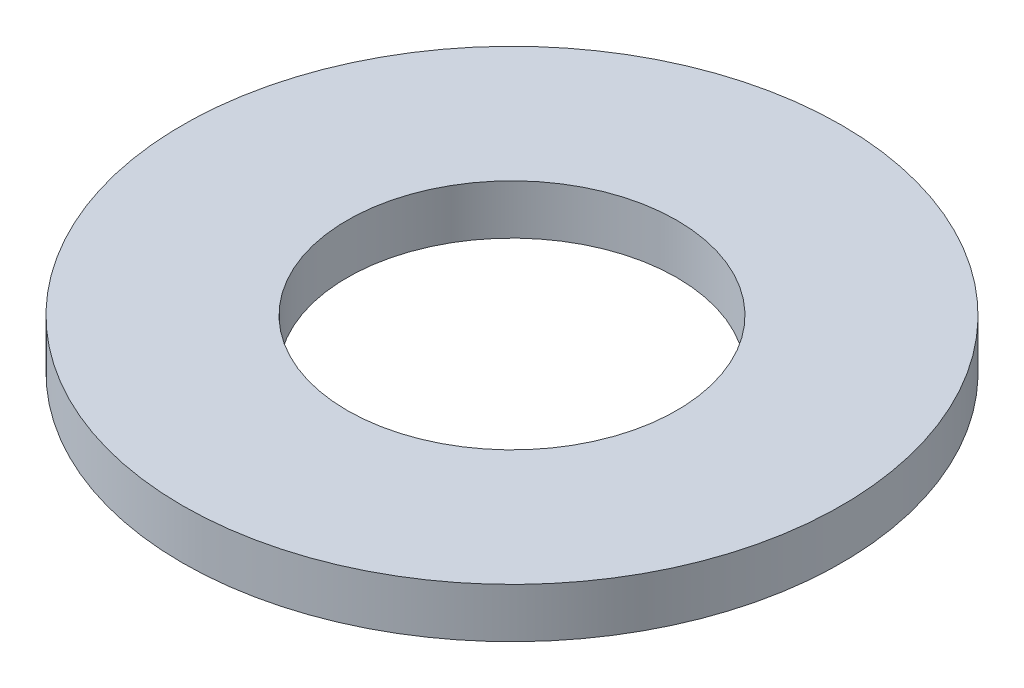
ISO-10303-21;
HEADER;
FILE_DESCRIPTION(('STEP AP214'),'2;1');
FILE_NAME('part.step','',(''),(''),'','','');
FILE_SCHEMA(('AUTOMOTIVE_DESIGN { 1 0 10303 214 1 1 1 1 }'));
ENDSEC;
DATA;
#1=APPLICATION_CONTEXT('core data for automotive mechanical design processes');
#2=APPLICATION_PROTOCOL_DEFINITION('international standard','automotive_design',2000,#1);
#3=PRODUCT_CONTEXT('',#1,'mechanical');
#4=PRODUCT('Part','Part','',(#3));
#5=PRODUCT_RELATED_PRODUCT_CATEGORY('part','',(#4));
#6=PRODUCT_DEFINITION_FORMATION('','',#4);
#7=PRODUCT_DEFINITION_CONTEXT('part definition',#1,'design');
#8=PRODUCT_DEFINITION('design','',#6,#7);
#9=PRODUCT_DEFINITION_SHAPE('','',#8);
#10=(LENGTH_UNIT() NAMED_UNIT(*) SI_UNIT(.MILLI.,.METRE.));
#11=(NAMED_UNIT(*) PLANE_ANGLE_UNIT() SI_UNIT($,.RADIAN.));
#12=(NAMED_UNIT(*) SI_UNIT($,.STERADIAN.) SOLID_ANGLE_UNIT());
#13=UNCERTAINTY_MEASURE_WITH_UNIT(LENGTH_MEASURE(1.E-05),#10,'distance_accuracy_value','');
#14=(GEOMETRIC_REPRESENTATION_CONTEXT(3) GLOBAL_UNCERTAINTY_ASSIGNED_CONTEXT((#13)) GLOBAL_UNIT_ASSIGNED_CONTEXT((#10,
#11,#12)) REPRESENTATION_CONTEXT('',''));
#15=CARTESIAN_POINT('',(0.,0.,0.));
#16=DIRECTION('',(0.,0.,1.));
#17=DIRECTION('',(1.,0.,0.));
#18=AXIS2_PLACEMENT_3D('',#15,#16,#17);
#19=CARTESIAN_POINT('',(0.,2.032,0.));
#20=DIRECTION('',(0.,-1.,0.));
#21=DIRECTION('',(0.,0.,-1.));
#22=AXIS2_PLACEMENT_3D('',#19,#20,#21);
#23=CYLINDRICAL_SURFACE('',#22,13.49375);
#24=CARTESIAN_POINT('',(0.,2.032,0.));
#25=DIRECTION('',(0.,1.,0.));
#26=DIRECTION('',(0.,0.,1.));
#27=AXIS2_PLACEMENT_3D('',#24,#25,#26);
#28=CIRCLE('',#27,13.49375);
#29=CARTESIAN_POINT('',(0.,2.032,13.49375));
#30=VERTEX_POINT('',#29);
#31=EDGE_CURVE('E10',#30,#30,#28,.T.);
#32=ORIENTED_EDGE('',*,*,#31,.F.);
#33=EDGE_LOOP('',(#32));
#34=FACE_BOUND('',#33,.T.);
#35=CARTESIAN_POINT('',(0.,0.,0.));
#36=DIRECTION('',(0.,1.,0.));
#37=DIRECTION('',(0.,0.,1.));
#38=AXIS2_PLACEMENT_3D('',#35,#36,#37);
#39=CIRCLE('',#38,13.49375);
#40=CARTESIAN_POINT('',(0.,0.,13.49375));
#41=VERTEX_POINT('',#40);
#42=EDGE_CURVE('E34',#41,#41,#39,.T.);
#43=ORIENTED_EDGE('',*,*,#42,.T.);
#44=EDGE_LOOP('',(#43));
#45=FACE_BOUND('',#44,.T.);
#46=ADVANCED_FACE('F31',(#34,#45),#23,.T.);
#47=CARTESIAN_POINT('',(0.,2.032,0.));
#48=DIRECTION('',(0.,1.,0.));
#49=DIRECTION('',(0.,0.,1.));
#50=AXIS2_PLACEMENT_3D('',#47,#48,#49);
#51=PLANE('',#50);
#52=CARTESIAN_POINT('',(0.,2.032,0.));
#53=DIRECTION('',(0.,1.,0.));
#54=DIRECTION('',(0.,0.,1.));
#55=AXIS2_PLACEMENT_3D('',#52,#53,#54);
#56=CIRCLE('',#55,6.746875);
#57=CARTESIAN_POINT('',(0.,2.032,6.746875));
#58=VERTEX_POINT('',#57);
#59=EDGE_CURVE('E43',#58,#58,#56,.T.);
#60=ORIENTED_EDGE('',*,*,#59,.F.);
#61=EDGE_LOOP('',(#60));
#62=FACE_BOUND('',#61,.T.);
#63=ORIENTED_EDGE('',*,*,#31,.T.);
#64=EDGE_LOOP('',(#63));
#65=FACE_BOUND('',#64,.T.);
#66=ADVANCED_FACE('F58',(#62,#65),#51,.T.);
#67=CARTESIAN_POINT('',(0.,0.,0.));
#68=DIRECTION('',(0.,1.,0.));
#69=DIRECTION('',(0.,0.,1.));
#70=AXIS2_PLACEMENT_3D('',#67,#68,#69);
#71=PLANE('',#70);
#72=CARTESIAN_POINT('',(0.,0.,0.));
#73=DIRECTION('',(0.,1.,0.));
#74=DIRECTION('',(0.,0.,1.));
#75=AXIS2_PLACEMENT_3D('',#72,#73,#74);
#76=CIRCLE('',#75,6.746875);
#77=CARTESIAN_POINT('',(0.,0.,6.746875));
#78=VERTEX_POINT('',#77);
#79=EDGE_CURVE('E41',#78,#78,#76,.T.);
#80=ORIENTED_EDGE('',*,*,#79,.T.);
#81=EDGE_LOOP('',(#80));
#82=FACE_BOUND('',#81,.T.);
#83=ORIENTED_EDGE('',*,*,#42,.F.);
#84=EDGE_LOOP('',(#83));
#85=FACE_BOUND('',#84,.T.);
#86=ADVANCED_FACE('F49',(#82,#85),#71,.F.);
#87=CARTESIAN_POINT('',(0.,0.,0.));
#88=DIRECTION('',(0.,1.,0.));
#89=DIRECTION('',(0.,0.,1.));
#90=AXIS2_PLACEMENT_3D('',#87,#88,#89);
#91=CYLINDRICAL_SURFACE('',#90,6.746875);
#92=ORIENTED_EDGE('',*,*,#79,.F.);
#93=EDGE_LOOP('',(#92));
#94=FACE_BOUND('',#93,.T.);
#95=ORIENTED_EDGE('',*,*,#59,.T.);
#96=EDGE_LOOP('',(#95));
#97=FACE_BOUND('',#96,.T.);
#98=ADVANCED_FACE('F52',(#94,#97),#91,.F.);
#99=CLOSED_SHELL('',(#46,#66,#86,#98));
#100=MANIFOLD_SOLID_BREP('B2',#99);
#101=ADVANCED_BREP_SHAPE_REPRESENTATION('',(#18,#100),#14);
#102=SHAPE_DEFINITION_REPRESENTATION(#9,#101);
ENDSEC;
END-ISO-10303-21;
